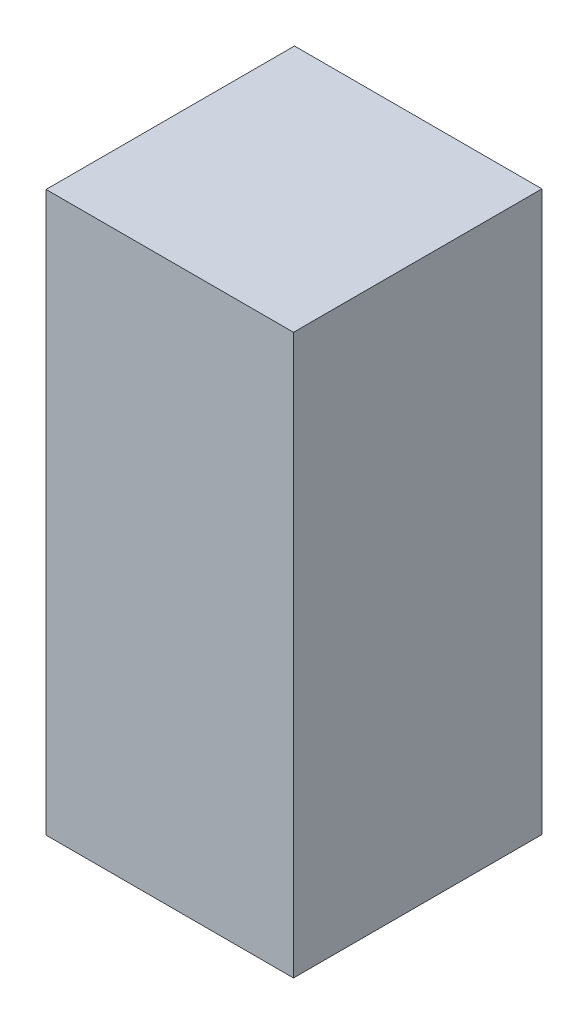
ISO-10303-21;
HEADER;
FILE_DESCRIPTION(('STEP AP214'),'2;1');
FILE_NAME('part.step','',(''),(''),'','','');
FILE_SCHEMA(('AUTOMOTIVE_DESIGN { 1 0 10303 214 1 1 1 1 }'));
ENDSEC;
DATA;
#1=APPLICATION_CONTEXT('core data for automotive mechanical design processes');
#2=APPLICATION_PROTOCOL_DEFINITION('international standard','automotive_design',2000,#1);
#3=PRODUCT_CONTEXT('',#1,'mechanical');
#4=PRODUCT('Part','Part','',(#3));
#5=PRODUCT_RELATED_PRODUCT_CATEGORY('part','',(#4));
#6=PRODUCT_DEFINITION_FORMATION('','',#4);
#7=PRODUCT_DEFINITION_CONTEXT('part definition',#1,'design');
#8=PRODUCT_DEFINITION('design','',#6,#7);
#9=PRODUCT_DEFINITION_SHAPE('','',#8);
#10=(LENGTH_UNIT() NAMED_UNIT(*) SI_UNIT(.MILLI.,.METRE.));
#11=(NAMED_UNIT(*) PLANE_ANGLE_UNIT() SI_UNIT($,.RADIAN.));
#12=(NAMED_UNIT(*) SI_UNIT($,.STERADIAN.) SOLID_ANGLE_UNIT());
#13=UNCERTAINTY_MEASURE_WITH_UNIT(LENGTH_MEASURE(1.E-05),#10,'distance_accuracy_value','');
#14=(GEOMETRIC_REPRESENTATION_CONTEXT(3) GLOBAL_UNCERTAINTY_ASSIGNED_CONTEXT((#13)) GLOBAL_UNIT_ASSIGNED_CONTEXT((#10,
#11,#12)) REPRESENTATION_CONTEXT('',''));
#15=CARTESIAN_POINT('',(0.,0.,0.));
#16=DIRECTION('',(0.,0.,1.));
#17=DIRECTION('',(1.,0.,0.));
#18=AXIS2_PLACEMENT_3D('',#15,#16,#17);
#19=CARTESIAN_POINT('',(1.88795,2.31245,0.));
#20=DIRECTION('',(1.,0.,0.));
#21=DIRECTION('',(0.,0.,1.));
#22=AXIS2_PLACEMENT_3D('',#19,#20,#21);
#23=PLANE('',#22);
#24=DIRECTION('',(0.,1.,0.));
#25=VECTOR('',#24,1.);
#26=CARTESIAN_POINT('',(1.88795,2.31245,0.1));
#27=LINE('',#26,#25);
#28=CARTESIAN_POINT('',(1.88795,2.31245,0.1));
#29=VERTEX_POINT('',#28);
#30=CARTESIAN_POINT('',(1.88795,2.53755,0.1));
#31=VERTEX_POINT('',#30);
#32=EDGE_CURVE('E11',#29,#31,#27,.T.);
#33=ORIENTED_EDGE('',*,*,#32,.T.);
#34=DIRECTION('',(0.,0.,1.));
#35=VECTOR('',#34,1.);
#36=CARTESIAN_POINT('',(1.88795,2.53755,0.));
#37=LINE('',#36,#35);
#38=CARTESIAN_POINT('',(1.88795,2.53755,0.));
#39=VERTEX_POINT('',#38);
#40=EDGE_CURVE('E24',#39,#31,#37,.T.);
#41=ORIENTED_EDGE('',*,*,#40,.F.);
#42=DIRECTION('',(0.,1.,0.));
#43=VECTOR('',#42,1.);
#44=CARTESIAN_POINT('',(1.88795,2.31245,0.));
#45=LINE('',#44,#43);
#46=CARTESIAN_POINT('',(1.88795,2.31245,0.));
#47=VERTEX_POINT('',#46);
#48=EDGE_CURVE('E86',#47,#39,#45,.T.);
#49=ORIENTED_EDGE('',*,*,#48,.F.);
#50=DIRECTION('',(0.,0.,1.));
#51=VECTOR('',#50,1.);
#52=CARTESIAN_POINT('',(1.88795,2.31245,0.));
#53=LINE('',#52,#51);
#54=EDGE_CURVE('E36',#47,#29,#53,.T.);
#55=ORIENTED_EDGE('',*,*,#54,.T.);
#56=EDGE_LOOP('',(#33,#41,#49,#55));
#57=FACE_BOUND('',#56,.T.);
#58=ADVANCED_FACE('F17',(#57),#23,.F.);
#59=CARTESIAN_POINT('',(1.98755,2.31245,0.));
#60=DIRECTION('',(1.,0.,0.));
#61=DIRECTION('',(0.,0.,1.));
#62=AXIS2_PLACEMENT_3D('',#59,#60,#61);
#63=PLANE('',#62);
#64=DIRECTION('',(0.,0.,1.));
#65=VECTOR('',#64,1.);
#66=CARTESIAN_POINT('',(1.98755,2.31245,0.));
#67=LINE('',#66,#65);
#68=CARTESIAN_POINT('',(1.98755,2.31245,0.));
#69=VERTEX_POINT('',#68);
#70=CARTESIAN_POINT('',(1.98755,2.31245,0.1));
#71=VERTEX_POINT('',#70);
#72=EDGE_CURVE('E83',#69,#71,#67,.T.);
#73=ORIENTED_EDGE('',*,*,#72,.F.);
#74=DIRECTION('',(0.,1.,0.));
#75=VECTOR('',#74,1.);
#76=CARTESIAN_POINT('',(1.98755,2.31245,0.));
#77=LINE('',#76,#75);
#78=CARTESIAN_POINT('',(1.98755,2.53755,0.));
#79=VERTEX_POINT('',#78);
#80=EDGE_CURVE('E63',#69,#79,#77,.T.);
#81=ORIENTED_EDGE('',*,*,#80,.T.);
#82=DIRECTION('',(0.,0.,1.));
#83=VECTOR('',#82,1.);
#84=CARTESIAN_POINT('',(1.98755,2.53755,0.));
#85=LINE('',#84,#83);
#86=CARTESIAN_POINT('',(1.98755,2.53755,0.1));
#87=VERTEX_POINT('',#86);
#88=EDGE_CURVE('E57',#79,#87,#85,.T.);
#89=ORIENTED_EDGE('',*,*,#88,.T.);
#90=DIRECTION('',(0.,1.,0.));
#91=VECTOR('',#90,1.);
#92=CARTESIAN_POINT('',(1.98755,2.31245,0.1));
#93=LINE('',#92,#91);
#94=EDGE_CURVE('E60',#71,#87,#93,.T.);
#95=ORIENTED_EDGE('',*,*,#94,.F.);
#96=EDGE_LOOP('',(#73,#81,#89,#95));
#97=FACE_BOUND('',#96,.T.);
#98=ADVANCED_FACE('F59',(#97),#63,.T.);
#99=CARTESIAN_POINT('',(1.88795,2.31245,0.));
#100=DIRECTION('',(0.,1.,0.));
#101=DIRECTION('',(0.,0.,1.));
#102=AXIS2_PLACEMENT_3D('',#99,#100,#101);
#103=PLANE('',#102);
#104=ORIENTED_EDGE('',*,*,#72,.T.);
#105=DIRECTION('',(1.,0.,0.));
#106=VECTOR('',#105,1.);
#107=CARTESIAN_POINT('',(1.88795,2.31245,0.1));
#108=LINE('',#107,#106);
#109=EDGE_CURVE('E71',#29,#71,#108,.T.);
#110=ORIENTED_EDGE('',*,*,#109,.F.);
#111=ORIENTED_EDGE('',*,*,#54,.F.);
#112=DIRECTION('',(1.,0.,0.));
#113=VECTOR('',#112,1.);
#114=CARTESIAN_POINT('',(1.88795,2.31245,0.));
#115=LINE('',#114,#113);
#116=EDGE_CURVE('E76',#47,#69,#115,.T.);
#117=ORIENTED_EDGE('',*,*,#116,.T.);
#118=EDGE_LOOP('',(#104,#110,#111,#117));
#119=FACE_BOUND('',#118,.T.);
#120=ADVANCED_FACE('F91',(#119),#103,.F.);
#121=CARTESIAN_POINT('',(1.88795,2.53755,0.));
#122=DIRECTION('',(0.,1.,0.));
#123=DIRECTION('',(0.,0.,1.));
#124=AXIS2_PLACEMENT_3D('',#121,#122,#123);
#125=PLANE('',#124);
#126=DIRECTION('',(1.,0.,0.));
#127=VECTOR('',#126,1.);
#128=CARTESIAN_POINT('',(1.88795,2.53755,0.));
#129=LINE('',#128,#127);
#130=EDGE_CURVE('E74',#39,#79,#129,.T.);
#131=ORIENTED_EDGE('',*,*,#130,.F.);
#132=ORIENTED_EDGE('',*,*,#40,.T.);
#133=DIRECTION('',(1.,0.,0.));
#134=VECTOR('',#133,1.);
#135=CARTESIAN_POINT('',(1.88795,2.53755,0.1));
#136=LINE('',#135,#134);
#137=EDGE_CURVE('E69',#31,#87,#136,.T.);
#138=ORIENTED_EDGE('',*,*,#137,.T.);
#139=ORIENTED_EDGE('',*,*,#88,.F.);
#140=EDGE_LOOP('',(#131,#132,#138,#139));
#141=FACE_BOUND('',#140,.T.);
#142=ADVANCED_FACE('F73',(#141),#125,.T.);
#143=CARTESIAN_POINT('',(1.88795,2.31245,0.));
#144=DIRECTION('',(0.,0.,1.));
#145=DIRECTION('',(1.,0.,0.));
#146=AXIS2_PLACEMENT_3D('',#143,#144,#145);
#147=PLANE('',#146);
#148=ORIENTED_EDGE('',*,*,#130,.T.);
#149=ORIENTED_EDGE('',*,*,#80,.F.);
#150=ORIENTED_EDGE('',*,*,#116,.F.);
#151=ORIENTED_EDGE('',*,*,#48,.T.);
#152=EDGE_LOOP('',(#148,#149,#150,#151));
#153=FACE_BOUND('',#152,.T.);
#154=ADVANCED_FACE('F89',(#153),#147,.F.);
#155=CARTESIAN_POINT('',(1.88795,2.31245,0.1));
#156=DIRECTION('',(0.,0.,1.));
#157=DIRECTION('',(1.,0.,0.));
#158=AXIS2_PLACEMENT_3D('',#155,#156,#157);
#159=PLANE('',#158);
#160=ORIENTED_EDGE('',*,*,#32,.F.);
#161=ORIENTED_EDGE('',*,*,#109,.T.);
#162=ORIENTED_EDGE('',*,*,#94,.T.);
#163=ORIENTED_EDGE('',*,*,#137,.F.);
#164=EDGE_LOOP('',(#160,#161,#162,#163));
#165=FACE_BOUND('',#164,.T.);
#166=ADVANCED_FACE('F68',(#165),#159,.T.);
#167=CLOSED_SHELL('',(#58,#98,#120,#142,#154,#166));
#168=MANIFOLD_SOLID_BREP('B1',#167);
#169=ADVANCED_BREP_SHAPE_REPRESENTATION('',(#18,#168),#14);
#170=SHAPE_DEFINITION_REPRESENTATION(#9,#169);
ENDSEC;
END-ISO-10303-21;
